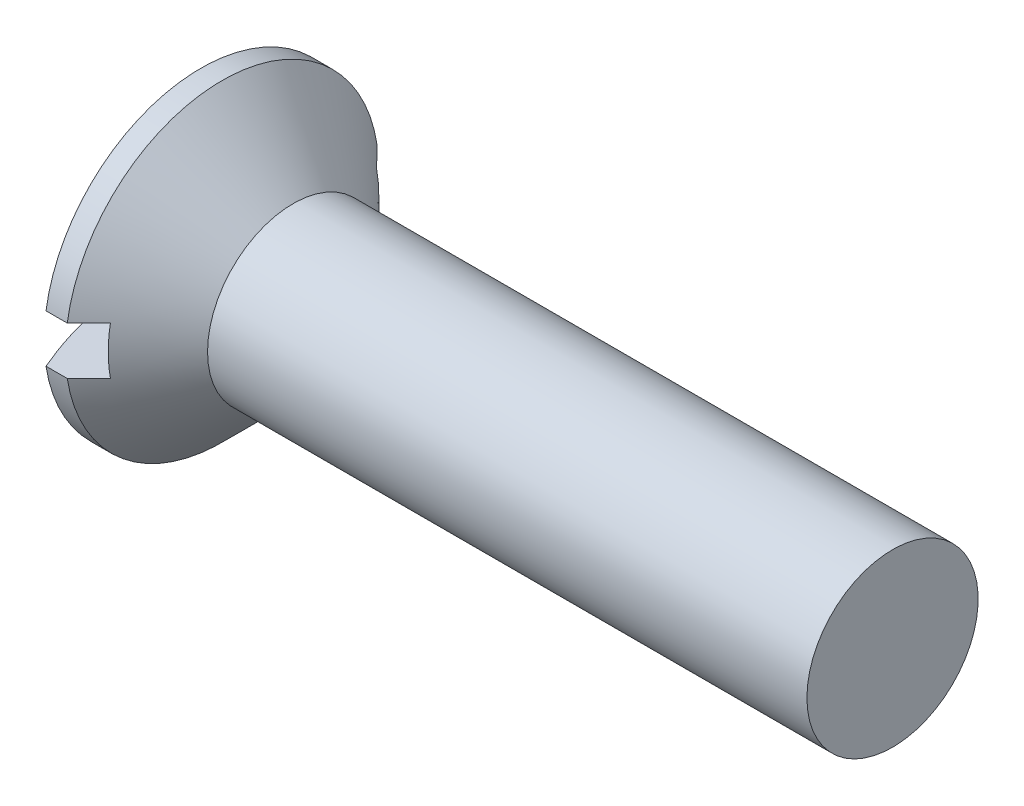
ISO-10303-21;
HEADER;
FILE_DESCRIPTION(('STEP AP214'),'2;1');
FILE_NAME('part.step','',(''),(''),'','','');
FILE_SCHEMA(('AUTOMOTIVE_DESIGN { 1 0 10303 214 1 1 1 1 }'));
ENDSEC;
DATA;
#1=APPLICATION_CONTEXT('core data for automotive mechanical design processes');
#2=APPLICATION_PROTOCOL_DEFINITION('international standard','automotive_design',2000,#1);
#3=PRODUCT_CONTEXT('',#1,'mechanical');
#4=PRODUCT('Part','Part','',(#3));
#5=PRODUCT_RELATED_PRODUCT_CATEGORY('part','',(#4));
#6=PRODUCT_DEFINITION_FORMATION('','',#4);
#7=PRODUCT_DEFINITION_CONTEXT('part definition',#1,'design');
#8=PRODUCT_DEFINITION('design','',#6,#7);
#9=PRODUCT_DEFINITION_SHAPE('','',#8);
#10=(LENGTH_UNIT() NAMED_UNIT(*) SI_UNIT(.MILLI.,.METRE.));
#11=(NAMED_UNIT(*) PLANE_ANGLE_UNIT() SI_UNIT($,.RADIAN.));
#12=(NAMED_UNIT(*) SI_UNIT($,.STERADIAN.) SOLID_ANGLE_UNIT());
#13=UNCERTAINTY_MEASURE_WITH_UNIT(LENGTH_MEASURE(1.E-05),#10,'distance_accuracy_value','');
#14=(GEOMETRIC_REPRESENTATION_CONTEXT(3) GLOBAL_UNCERTAINTY_ASSIGNED_CONTEXT((#13)) GLOBAL_UNIT_ASSIGNED_CONTEXT((#10,
#11,#12)) REPRESENTATION_CONTEXT('',''));
#15=CARTESIAN_POINT('',(0.,0.,0.));
#16=DIRECTION('',(0.,0.,1.));
#17=DIRECTION('',(1.,0.,0.));
#18=AXIS2_PLACEMENT_3D('',#15,#16,#17);
#19=CARTESIAN_POINT('',(4.4,-1.4,-9.15));
#20=DIRECTION('',(1.,0.,0.));
#21=DIRECTION('',(0.,0.,-1.));
#22=AXIS2_PLACEMENT_3D('',#19,#20,#21);
#23=PLANE('',#22);
#24=DIRECTION('',(0.,0.,-1.));
#25=VECTOR('',#24,1.);
#26=CARTESIAN_POINT('',(4.4,0.751153846153878,-9.15));
#27=LINE('',#26,#25);
#28=CARTESIAN_POINT('',(4.4,0.751153846153849,-0.751153846153847));
#29=VERTEX_POINT('',#28);
#30=CARTESIAN_POINT('',(4.4,0.751153846153854,-2.49538461538461));
#31=VERTEX_POINT('',#30);
#32=EDGE_CURVE('E205',#29,#31,#27,.T.);
#33=ORIENTED_EDGE('',*,*,#32,.F.);
#34=DIRECTION('',(0.,-1.,0.));
#35=VECTOR('',#34,1.);
#36=CARTESIAN_POINT('',(4.4,-1.4,-0.751153846153848));
#37=LINE('',#36,#35);
#38=CARTESIAN_POINT('',(4.4,1.4,-0.751153846153848));
#39=VERTEX_POINT('',#38);
#40=EDGE_CURVE('E326',#39,#29,#37,.T.);
#41=ORIENTED_EDGE('',*,*,#40,.F.);
#42=DIRECTION('',(0.,0.,-1.));
#43=VECTOR('',#42,1.);
#44=CARTESIAN_POINT('',(4.4,1.4,9.15));
#45=LINE('',#44,#43);
#46=CARTESIAN_POINT('',(4.4,1.4,-7.77372673048254));
#47=VERTEX_POINT('',#46);
#48=EDGE_CURVE('E57',#39,#47,#45,.T.);
#49=ORIENTED_EDGE('',*,*,#48,.T.);
#50=CARTESIAN_POINT('',(4.4,0.,0.));
#51=DIRECTION('',(1.,0.,0.));
#52=DIRECTION('',(0.,0.,-1.));
#53=AXIS2_PLACEMENT_3D('',#50,#51,#52);
#54=CIRCLE('',#53,7.89878644351262);
#55=CARTESIAN_POINT('',(4.4,-1.4,-7.77372673048254));
#56=VERTEX_POINT('',#55);
#57=EDGE_CURVE('E267',#56,#47,#54,.T.);
#58=ORIENTED_EDGE('',*,*,#57,.F.);
#59=DIRECTION('',(0.,0.,1.));
#60=VECTOR('',#59,1.);
#61=CARTESIAN_POINT('',(4.4,-1.4,-9.15));
#62=LINE('',#61,#60);
#63=CARTESIAN_POINT('',(4.4,-1.4,-0.751153846153848));
#64=VERTEX_POINT('',#63);
#65=EDGE_CURVE('E230',#56,#64,#62,.T.);
#66=ORIENTED_EDGE('',*,*,#65,.T.);
#67=CARTESIAN_POINT('',(4.4,-0.751153846153843,-0.751153846153847));
#68=VERTEX_POINT('',#67);
#69=EDGE_CURVE('E336',#68,#64,#37,.T.);
#70=ORIENTED_EDGE('',*,*,#69,.F.);
#71=DIRECTION('',(0.,0.,1.));
#72=VECTOR('',#71,1.);
#73=CARTESIAN_POINT('',(4.4,-0.751153846153813,-9.15));
#74=LINE('',#73,#72);
#75=CARTESIAN_POINT('',(4.4,-0.751153846153837,-2.49538461538462));
#76=VERTEX_POINT('',#75);
#77=EDGE_CURVE('E386',#76,#68,#74,.T.);
#78=ORIENTED_EDGE('',*,*,#77,.F.);
#79=DIRECTION('',(0.,1.,0.));
#80=VECTOR('',#79,1.);
#81=CARTESIAN_POINT('',(4.4,-1.40000000000002,-2.49538461538462));
#82=LINE('',#81,#80);
#83=EDGE_CURVE('E176',#76,#31,#82,.T.);
#84=ORIENTED_EDGE('',*,*,#83,.T.);
#85=EDGE_LOOP('',(#33,#41,#49,#58,#66,#70,#78,#84));
#86=FACE_BOUND('',#85,.T.);
#87=ADVANCED_FACE('F34',(#86),#23,.F.);
#88=DIRECTION('',(0.,0.,-1.));
#89=VECTOR('',#88,1.);
#90=CARTESIAN_POINT('',(4.4,0.751153846153878,-9.15));
#91=LINE('',#90,#89);
#92=CARTESIAN_POINT('',(4.4,0.751153846153837,2.49538461538461));
#93=VERTEX_POINT('',#92);
#94=CARTESIAN_POINT('',(4.4,0.751153846153844,0.751153846153845));
#95=VERTEX_POINT('',#94);
#96=EDGE_CURVE('E164',#93,#95,#91,.T.);
#97=ORIENTED_EDGE('',*,*,#96,.F.);
#98=DIRECTION('',(0.,-1.,0.));
#99=VECTOR('',#98,1.);
#100=CARTESIAN_POINT('',(4.4,-1.40000000000004,2.49538461538461));
#101=LINE('',#100,#99);
#102=CARTESIAN_POINT('',(4.4,-0.751153846153854,2.49538461538461));
#103=VERTEX_POINT('',#102);
#104=EDGE_CURVE('E175',#93,#103,#101,.T.);
#105=ORIENTED_EDGE('',*,*,#104,.T.);
#106=DIRECTION('',(0.,0.,1.));
#107=VECTOR('',#106,1.);
#108=CARTESIAN_POINT('',(4.4,-0.751153846153813,-9.15));
#109=LINE('',#108,#107);
#110=CARTESIAN_POINT('',(4.4,-0.751153846153849,0.751153846153845));
#111=VERTEX_POINT('',#110);
#112=EDGE_CURVE('E390',#111,#103,#109,.T.);
#113=ORIENTED_EDGE('',*,*,#112,.F.);
#114=DIRECTION('',(0.,1.,0.));
#115=VECTOR('',#114,1.);
#116=CARTESIAN_POINT('',(4.4,-1.4,0.751153846153844));
#117=LINE('',#116,#115);
#118=CARTESIAN_POINT('',(4.4,-1.4,0.751153846153844));
#119=VERTEX_POINT('',#118);
#120=EDGE_CURVE('E339',#119,#111,#117,.T.);
#121=ORIENTED_EDGE('',*,*,#120,.F.);
#122=CARTESIAN_POINT('',(4.4,-1.4,7.77372673048254));
#123=VERTEX_POINT('',#122);
#124=EDGE_CURVE('E229',#119,#123,#62,.T.);
#125=ORIENTED_EDGE('',*,*,#124,.T.);
#126=CARTESIAN_POINT('',(4.4,1.4,7.77372673048254));
#127=VERTEX_POINT('',#126);
#128=EDGE_CURVE('E271',#127,#123,#54,.T.);
#129=ORIENTED_EDGE('',*,*,#128,.F.);
#130=CARTESIAN_POINT('',(4.4,1.4,0.751153846153845));
#131=VERTEX_POINT('',#130);
#132=EDGE_CURVE('E226',#127,#131,#45,.T.);
#133=ORIENTED_EDGE('',*,*,#132,.T.);
#134=EDGE_CURVE('E356',#95,#131,#117,.T.);
#135=ORIENTED_EDGE('',*,*,#134,.F.);
#136=EDGE_LOOP('',(#97,#105,#113,#121,#125,#129,#133,#135));
#137=FACE_BOUND('',#136,.T.);
#138=ADVANCED_FACE('F317',(#137),#23,.F.);
#139=CARTESIAN_POINT('',(7.91393402264894,0.,-0.484537173806007));
#140=DIRECTION('',(-0.0756566651152588,0.,0.997133927325531));
#141=DIRECTION('',(0.997133927325531,0.,0.0756566651152588));
#142=AXIS2_PLACEMENT_3D('',#139,#140,#141);
#143=PLANE('',#142);
#144=ORIENTED_EDGE('',*,*,#40,.T.);
#145=DIRECTION('',(0.994292357349116,-0.0754410634771884,0.0754410634771882));
#146=VECTOR('',#145,1.);
#147=CARTESIAN_POINT('',(7.95027938516743,0.48177950119534,-0.481779501195338));
#148=LINE('',#147,#146);
#149=CARTESIAN_POINT('',(7.15,0.542500000000002,-0.542499999999998));
#150=VERTEX_POINT('',#149);
#151=EDGE_CURVE('E330',#29,#150,#148,.T.);
#152=ORIENTED_EDGE('',*,*,#151,.T.);
#153=DIRECTION('',(0.813773502738753,-0.577893001420423,0.0617443531798285));
#154=VECTOR('',#153,1.);
#155=CARTESIAN_POINT('',(0.,5.62,-1.085));
#156=LINE('',#155,#154);
#157=CARTESIAN_POINT('',(0.617987345860282,5.18114255264257,-1.03811075033158));
#158=VERTEX_POINT('',#157);
#159=EDGE_CURVE('E187',#158,#150,#156,.T.);
#160=ORIENTED_EDGE('',*,*,#159,.F.);
#161=CARTESIAN_POINT('',(22.8507741936033,0.,0.648782517486683));
#162=DIRECTION('',(-0.0756566651152588,0.,0.997133927325531));
#163=DIRECTION('',(0.997133927325531,0.,0.0756566651152588));
#164=AXIS2_PLACEMENT_3D('',#161,#162,#163);
#165=CIRCLE('',#164,22.8907548600956);
#166=CARTESIAN_POINT('',(0.0683552371710354,1.4,-1.07981360613073));
#167=VERTEX_POINT('',#166);
#168=EDGE_CURVE('E223',#167,#158,#165,.F.);
#169=ORIENTED_EDGE('',*,*,#168,.F.);
#170=DIRECTION('',(0.997133927325531,0.,0.0756566651152588));
#171=VECTOR('',#170,1.);
#172=CARTESIAN_POINT('',(5.14694133934077,1.4,-0.694480324952115));
#173=LINE('',#172,#171);
#174=EDGE_CURVE('E218',#167,#39,#173,.T.);
#175=ORIENTED_EDGE('',*,*,#174,.T.);
#176=EDGE_LOOP('',(#144,#152,#160,#169,#175));
#177=FACE_BOUND('',#176,.T.);
#178=ADVANCED_FACE('F321',(#177),#143,.T.);
#179=DIRECTION('',(0.813773502738753,0.577893001420423,0.0617443531798285));
#180=VECTOR('',#179,1.);
#181=CARTESIAN_POINT('',(0.,-5.62,-1.085));
#182=LINE('',#181,#180);
#183=CARTESIAN_POINT('',(0.617987345860282,-5.18114255264258,-1.03811075033158));
#184=VERTEX_POINT('',#183);
#185=CARTESIAN_POINT('',(7.15,-0.5425,-0.5425));
#186=VERTEX_POINT('',#185);
#187=EDGE_CURVE('E188',#184,#186,#182,.T.);
#188=ORIENTED_EDGE('',*,*,#187,.T.);
#189=DIRECTION('',(-0.994292357349116,-0.0754410634771878,-0.0754410634771882));
#190=VECTOR('',#189,1.);
#191=CARTESIAN_POINT('',(7.95027938516743,-0.481779501195337,-0.481779501195339));
#192=LINE('',#191,#190);
#193=EDGE_CURVE('E388',#186,#68,#192,.T.);
#194=ORIENTED_EDGE('',*,*,#193,.T.);
#195=ORIENTED_EDGE('',*,*,#69,.T.);
#196=DIRECTION('',(-0.997133927325531,0.,-0.0756566651152588));
#197=VECTOR('',#196,1.);
#198=CARTESIAN_POINT('',(3.7663924939912,-1.4,-0.799228261819549));
#199=LINE('',#198,#197);
#200=CARTESIAN_POINT('',(0.0683552371710319,-1.4,-1.07981360613073));
#201=VERTEX_POINT('',#200);
#202=EDGE_CURVE('E216',#64,#201,#199,.T.);
#203=ORIENTED_EDGE('',*,*,#202,.T.);
#204=CARTESIAN_POINT('',(22.8507741936033,0.,0.648782517486683));
#205=DIRECTION('',(-0.0756566651152588,0.,0.997133927325531));
#206=DIRECTION('',(0.997133927325531,0.,0.0756566651152588));
#207=AXIS2_PLACEMENT_3D('',#204,#205,#206);
#208=CIRCLE('',#207,22.8907548600956);
#209=EDGE_CURVE('E220',#184,#201,#208,.F.);
#210=ORIENTED_EDGE('',*,*,#209,.F.);
#211=EDGE_LOOP('',(#188,#194,#195,#203,#210));
#212=FACE_BOUND('',#211,.T.);
#213=ADVANCED_FACE('F373',(#212),#143,.T.);
#214=CARTESIAN_POINT('',(7.91393402264894,0.,0.484537173806007));
#215=DIRECTION('',(-0.0756566651152587,0.,-0.997133927325531));
#216=DIRECTION('',(-0.997133927325531,0.,0.0756566651152587));
#217=AXIS2_PLACEMENT_3D('',#214,#215,#216);
#218=PLANE('',#217);
#219=DIRECTION('',(0.813773502738753,-0.577893001420423,-0.0617443531798285));
#220=VECTOR('',#219,1.);
#221=CARTESIAN_POINT('',(0.,5.62,1.085));
#222=LINE('',#221,#220);
#223=CARTESIAN_POINT('',(0.617987345860278,5.18114255264258,1.03811075033158));
#224=VERTEX_POINT('',#223);
#225=CARTESIAN_POINT('',(7.15,0.542499999999998,0.542500000000002));
#226=VERTEX_POINT('',#225);
#227=EDGE_CURVE('E180',#224,#226,#222,.T.);
#228=ORIENTED_EDGE('',*,*,#227,.T.);
#229=DIRECTION('',(-0.994292357349116,0.0754410634771879,0.0754410634771881));
#230=VECTOR('',#229,1.);
#231=CARTESIAN_POINT('',(7.95027938516743,0.481779501195337,0.481779501195339));
#232=LINE('',#231,#230);
#233=EDGE_CURVE('E11',#226,#95,#232,.T.);
#234=ORIENTED_EDGE('',*,*,#233,.T.);
#235=ORIENTED_EDGE('',*,*,#134,.T.);
#236=DIRECTION('',(-0.997133927325531,0.,0.0756566651152587));
#237=VECTOR('',#236,1.);
#238=CARTESIAN_POINT('',(3.7663924939912,1.4,0.799228261819549));
#239=LINE('',#238,#237);
#240=CARTESIAN_POINT('',(0.0683552371710319,1.4,1.07981360613073));
#241=VERTEX_POINT('',#240);
#242=EDGE_CURVE('E210',#131,#241,#239,.T.);
#243=ORIENTED_EDGE('',*,*,#242,.T.);
#244=CARTESIAN_POINT('',(22.8507741936033,0.,-0.648782517486681));
#245=DIRECTION('',(-0.0756566651152587,0.,-0.997133927325531));
#246=DIRECTION('',(-0.997133927325531,0.,0.0756566651152587));
#247=AXIS2_PLACEMENT_3D('',#244,#245,#246);
#248=CIRCLE('',#247,22.8907548600956);
#249=EDGE_CURVE('E183',#224,#241,#248,.F.);
#250=ORIENTED_EDGE('',*,*,#249,.F.);
#251=EDGE_LOOP('',(#228,#234,#235,#243,#250));
#252=FACE_BOUND('',#251,.T.);
#253=ADVANCED_FACE('F181',(#252),#218,.T.);
#254=ORIENTED_EDGE('',*,*,#120,.T.);
#255=DIRECTION('',(0.994292357349116,0.0754410634771883,-0.0754410634771881));
#256=VECTOR('',#255,1.);
#257=CARTESIAN_POINT('',(7.95027938516743,-0.48177950119534,0.481779501195338));
#258=LINE('',#257,#256);
#259=CARTESIAN_POINT('',(7.15,-0.5425,0.5425));
#260=VERTEX_POINT('',#259);
#261=EDGE_CURVE('E392',#111,#260,#258,.T.);
#262=ORIENTED_EDGE('',*,*,#261,.T.);
#263=DIRECTION('',(0.813773502738753,0.577893001420422,-0.0617443531798284));
#264=VECTOR('',#263,1.);
#265=CARTESIAN_POINT('',(0.,-5.62,1.085));
#266=LINE('',#265,#264);
#267=CARTESIAN_POINT('',(0.617987345860282,-5.18114255264258,1.03811075033158));
#268=VERTEX_POINT('',#267);
#269=EDGE_CURVE('E379',#268,#260,#266,.T.);
#270=ORIENTED_EDGE('',*,*,#269,.F.);
#271=CARTESIAN_POINT('',(22.8507741936033,0.,-0.648782517486681));
#272=DIRECTION('',(-0.0756566651152587,0.,-0.997133927325531));
#273=DIRECTION('',(-0.997133927325531,0.,0.0756566651152587));
#274=AXIS2_PLACEMENT_3D('',#271,#272,#273);
#275=CIRCLE('',#274,22.8907548600956);
#276=CARTESIAN_POINT('',(0.0683552371710319,-1.4,1.07981360613073));
#277=VERTEX_POINT('',#276);
#278=EDGE_CURVE('E212',#277,#268,#275,.F.);
#279=ORIENTED_EDGE('',*,*,#278,.F.);
#280=DIRECTION('',(0.997133927325531,0.,-0.0756566651152587));
#281=VECTOR('',#280,1.);
#282=CARTESIAN_POINT('',(5.14694133934077,-1.4,0.694480324952115));
#283=LINE('',#282,#281);
#284=EDGE_CURVE('E49',#277,#119,#283,.T.);
#285=ORIENTED_EDGE('',*,*,#284,.T.);
#286=EDGE_LOOP('',(#254,#262,#270,#279,#285));
#287=FACE_BOUND('',#286,.T.);
#288=ADVANCED_FACE('F403',(#287),#218,.T.);
#289=CARTESIAN_POINT('',(22.9,0.,0.));
#290=DIRECTION('',(-1.,0.,0.));
#291=DIRECTION('',(0.,-1.,0.));
#292=AXIS2_PLACEMENT_3D('',#289,#290,#291);
#293=SPHERICAL_SURFACE('',#292,22.9);
#294=CARTESIAN_POINT('',(22.9,1.4,0.));
#295=DIRECTION('',(0.,1.,0.));
#296=DIRECTION('',(0.,0.,1.));
#297=AXIS2_PLACEMENT_3D('',#294,#295,#296);
#298=CIRCLE('',#297,22.8571651785605);
#299=CARTESIAN_POINT('',(1.90744179476927,1.4,-9.0422618851701));
#300=VERTEX_POINT('',#299);
#301=EDGE_CURVE('E246',#167,#300,#298,.F.);
#302=ORIENTED_EDGE('',*,*,#301,.F.);
#303=ORIENTED_EDGE('',*,*,#168,.T.);
#304=CARTESIAN_POINT('',(17.8760956364067,-7.07452805508461,0.));
#305=DIRECTION('',(0.57899773071887,0.815329153055622,0.));
#306=DIRECTION('',(-0.815329153055622,0.57899773071887,0.));
#307=AXIS2_PLACEMENT_3D('',#304,#305,#306);
#308=CIRCLE('',#307,21.1924854074101);
#309=EDGE_CURVE('E42',#224,#158,#308,.F.);
#310=ORIENTED_EDGE('',*,*,#309,.F.);
#311=ORIENTED_EDGE('',*,*,#249,.T.);
#312=CARTESIAN_POINT('',(1.90744179476927,1.4,9.04226188517011));
#313=VERTEX_POINT('',#312);
#314=EDGE_CURVE('E247',#313,#241,#298,.F.);
#315=ORIENTED_EDGE('',*,*,#314,.F.);
#316=CARTESIAN_POINT('',(1.90744179476927,0.,0.));
#317=DIRECTION('',(-1.,0.,0.));
#318=DIRECTION('',(0.,0.,1.));
#319=AXIS2_PLACEMENT_3D('',#316,#317,#318);
#320=CIRCLE('',#319,9.15);
#321=EDGE_CURVE('E266',#313,#300,#320,.T.);
#322=ORIENTED_EDGE('',*,*,#321,.T.);
#323=EDGE_LOOP('',(#302,#303,#310,#311,#315,#322));
#324=FACE_BOUND('',#323,.T.);
#325=ADVANCED_FACE('F343',(#324),#293,.T.);
#326=CARTESIAN_POINT('',(17.8760956364067,7.07452805508461,0.));
#327=DIRECTION('',(0.57899773071887,-0.815329153055622,0.));
#328=DIRECTION('',(0.815329153055622,0.57899773071887,0.));
#329=AXIS2_PLACEMENT_3D('',#326,#327,#328);
#330=CIRCLE('',#329,21.1924854074101);
#331=EDGE_CURVE('E335',#184,#268,#330,.F.);
#332=ORIENTED_EDGE('',*,*,#331,.F.);
#333=ORIENTED_EDGE('',*,*,#209,.T.);
#334=CARTESIAN_POINT('',(22.9,-1.4,0.));
#335=DIRECTION('',(0.,-1.,0.));
#336=DIRECTION('',(0.,0.,-1.));
#337=AXIS2_PLACEMENT_3D('',#334,#335,#336);
#338=CIRCLE('',#337,22.8571651785605);
#339=CARTESIAN_POINT('',(1.90744179476927,-1.4,-9.04226188517011));
#340=VERTEX_POINT('',#339);
#341=EDGE_CURVE('E237',#340,#201,#338,.F.);
#342=ORIENTED_EDGE('',*,*,#341,.F.);
#343=CARTESIAN_POINT('',(1.90744179476927,-1.4,9.0422618851701));
#344=VERTEX_POINT('',#343);
#345=EDGE_CURVE('E263',#340,#344,#320,.T.);
#346=ORIENTED_EDGE('',*,*,#345,.T.);
#347=EDGE_CURVE('E236',#277,#344,#338,.F.);
#348=ORIENTED_EDGE('',*,*,#347,.F.);
#349=ORIENTED_EDGE('',*,*,#278,.T.);
#350=EDGE_LOOP('',(#332,#333,#342,#346,#348,#349));
#351=FACE_BOUND('',#350,.T.);
#352=ADVANCED_FACE('F303',(#351),#293,.T.);
#353=CARTESIAN_POINT('',(4.4,1.4,9.15));
#354=DIRECTION('',(0.,1.,0.));
#355=DIRECTION('',(0.,0.,1.));
#356=AXIS2_PLACEMENT_3D('',#353,#354,#355);
#357=PLANE('',#356);
#358=ORIENTED_EDGE('',*,*,#174,.F.);
#359=ORIENTED_EDGE('',*,*,#301,.T.);
#360=DIRECTION('',(-1.,0.,0.));
#361=VECTOR('',#360,1.);
#362=CARTESIAN_POINT('',(-15.875,1.4,-9.0422618851701));
#363=LINE('',#362,#361);
#364=CARTESIAN_POINT('',(3.14878644351263,1.4,-9.0422618851701));
#365=VERTEX_POINT('',#364);
#366=EDGE_CURVE('E243',#365,#300,#363,.T.);
#367=ORIENTED_EDGE('',*,*,#366,.F.);
#368=CARTESIAN_POINT('',(-7.857048146597,1.4,20.1071546476338));
#369=CARTESIAN_POINT('',(-7.16240173454339,1.4,19.4108129604451));
#370=CARTESIAN_POINT('',(-6.4678297758022,1.4,18.7143969459536));
#371=CARTESIAN_POINT('',(-5.0789137994183,1.4,17.3213021944131));
#372=CARTESIAN_POINT('',(-4.384569788051,1.4,16.6246234511077));
#373=CARTESIAN_POINT('',(-2.9958169251593,1.4,15.2305158546289));
#374=CARTESIAN_POINT('',(-2.30140827464231,1.4,14.5330868011787));
#375=CARTESIAN_POINT('',(-0.913133661235677,1.4,13.1377232868626));
#376=CARTESIAN_POINT('',(-0.219267685269571,1.4,12.4397888390074));
#377=CARTESIAN_POINT('',(1.16766516004261,1.4,11.0430452680403));
#378=CARTESIAN_POINT('',(1.860731980637,1.4,10.3442360964824));
#379=CARTESIAN_POINT('',(2.89921288895363,1.4,9.29486121439367));
#380=CARTESIAN_POINT('',(3.24519991186702,1.4,8.94486259435679));
#381=CARTESIAN_POINT('',(3.93662486381058,1.4,8.24432826145728));
#382=CARTESIAN_POINT('',(4.28206279690165,1.4,7.89379255260482));
#383=CARTESIAN_POINT('',(4.97201098407667,1.4,7.19206058266475));
#384=CARTESIAN_POINT('',(5.31652153057943,1.4,6.84086460915768));
#385=CARTESIAN_POINT('',(6.0043198550081,1.4,6.1372554152688));
#386=CARTESIAN_POINT('',(6.34760759767043,1.4,5.78484216035078));
#387=CARTESIAN_POINT('',(6.86094083207756,1.4,5.25471885267416));
#388=CARTESIAN_POINT('',(7.03177435251846,1.4,5.07777217670582));
#389=CARTESIAN_POINT('',(7.3727219976139,1.4,4.72318743380958));
#390=CARTESIAN_POINT('',(7.54283612457629,1.4,4.5455493691032));
#391=CARTESIAN_POINT('',(7.88205567895868,1.4,4.18932774848586));
#392=CARTESIAN_POINT('',(8.05116115256099,1.4,4.010744236581));
#393=CARTESIAN_POINT('',(8.38792170913193,1.4,3.6522159938797));
#394=CARTESIAN_POINT('',(8.55557681829037,1.4,3.47227128777332));
#395=CARTESIAN_POINT('',(8.76748560072488,1.4,3.24198243681544));
#396=CARTESIAN_POINT('',(8.81277819707361,1.4,3.19259415231655));
#397=CARTESIAN_POINT('',(8.90317039805928,1.4,3.09364104016524));
#398=CARTESIAN_POINT('',(8.94827000208926,1.4,3.0440762119585));
#399=CARTESIAN_POINT('',(9.08324361960469,1.4,2.8950805018967));
#400=CARTESIAN_POINT('',(9.17278950728053,1.4,2.79535157355364));
#401=CARTESIAN_POINT('',(9.3508320888316,1.4,2.59472118043883));
#402=CARTESIAN_POINT('',(9.43932721937955,1.4,2.4938183259168));
#403=CARTESIAN_POINT('',(9.614699972968,1.4,2.29062509774684));
#404=CARTESIAN_POINT('',(9.70157772808994,1.4,2.18833483858974));
#405=CARTESIAN_POINT('',(9.85908268519032,1.4,1.99861822286032));
#406=CARTESIAN_POINT('',(9.93005523883935,1.4,1.91147949716551));
#407=CARTESIAN_POINT('',(10.0697225589233,1.4,1.73539857671608));
#408=CARTESIAN_POINT('',(10.1384175632151,1.4,1.64645657186115));
#409=CARTESIAN_POINT('',(10.2724705720187,1.4,1.46615153054903));
#410=CARTESIAN_POINT('',(10.3378304303692,1.4,1.37478988291309));
#411=CARTESIAN_POINT('',(10.4635064959422,1.4,1.18868577560423));
#412=CARTESIAN_POINT('',(10.5238261057651,1.4,1.09394565935052));
#413=CARTESIAN_POINT('',(10.6326133150829,1.4,0.906410779158184));
#414=CARTESIAN_POINT('',(10.6816099494598,1.4,0.813927939950042));
#415=CARTESIAN_POINT('',(10.768441254158,1.4,0.623741334762394));
#416=CARTESIAN_POINT('',(10.8062957802322,1.4,0.526047227156338));
#417=CARTESIAN_POINT('',(10.8471996480684,1.4,0.385477581345689));
#418=CARTESIAN_POINT('',(10.8575324900997,1.4,0.344715229152776));
#419=CARTESIAN_POINT('',(10.8749530279124,1.4,0.262512597980199));
#420=CARTESIAN_POINT('',(10.882042416588,1.4,0.22107268437381));
#421=CARTESIAN_POINT('',(10.8926248599701,1.4,0.137809044984982));
#422=CARTESIAN_POINT('',(10.896124636229,1.4,0.0959861850436));
#423=CARTESIAN_POINT('',(10.8993592539135,1.4,0.0121930480465017));
#424=CARTESIAN_POINT('',(10.899094143624,1.4,-0.0297772271117035));
#425=CARTESIAN_POINT('',(10.8948149534949,1.4,-0.113507966191157));
#426=CARTESIAN_POINT('',(10.8908022173129,1.4,-0.155268499917299));
#427=CARTESIAN_POINT('',(10.8792459740393,1.4,-0.238299671163265));
#428=CARTESIAN_POINT('',(10.8717017006016,1.4,-0.279570200357654));
#429=CARTESIAN_POINT('',(10.8534259161864,1.4,-0.361477258398673));
#430=CARTESIAN_POINT('',(10.8426880522661,1.4,-0.402112351974105));
#431=CARTESIAN_POINT('',(10.8184565568997,1.4,-0.482540705127475));
#432=CARTESIAN_POINT('',(10.8049629204321,1.4,-0.522333963171272));
#433=CARTESIAN_POINT('',(10.7534817229732,1.4,-0.66062373817725));
#434=CARTESIAN_POINT('',(10.7093295480848,1.4,-0.756824096864698));
#435=CARTESIAN_POINT('',(10.611885326994,1.4,-0.944505351940633));
#436=CARTESIAN_POINT('',(10.5585722859902,1.4,-1.03597476523033));
#437=CARTESIAN_POINT('',(10.4457034448116,1.4,-1.21608752073851));
#438=CARTESIAN_POINT('',(10.3860957462745,1.4,-1.30469799229635));
#439=CARTESIAN_POINT('',(10.2938557677635,1.4,-1.4355101257757));
#440=CARTESIAN_POINT('',(10.2626548857484,1.4,-1.47874135004981));
#441=CARTESIAN_POINT('',(10.1994575270918,1.4,-1.56461754012874));
#442=CARTESIAN_POINT('',(10.1674610779967,1.4,-1.60726252615286));
#443=CARTESIAN_POINT('',(10.0628879562799,1.4,-1.74442534089264));
#444=CARTESIAN_POINT('',(9.98900731385959,1.4,-1.83794788506663));
#445=CARTESIAN_POINT('',(9.83902850276875,1.4,-2.02320270323648));
#446=CARTESIAN_POINT('',(9.76293004312599,1.4,-2.11493473966193));
#447=CARTESIAN_POINT('',(9.60912484168818,1.4,-2.29709862281036));
#448=CARTESIAN_POINT('',(9.53141748345873,1.4,-2.38752994781703));
#449=CARTESIAN_POINT('',(9.37483606047006,1.4,-2.56737831217361));
#450=CARTESIAN_POINT('',(9.29596196265418,1.4,-2.65679532265813));
#451=CARTESIAN_POINT('',(9.05779287389105,1.4,-2.92415166595302));
#452=CARTESIAN_POINT('',(8.89718647029795,1.4,-3.10092142858316));
#453=CARTESIAN_POINT('',(8.57389696740277,1.4,-3.45246333870868));
#454=CARTESIAN_POINT('',(8.41121436586402,1.4,-3.62723594665571));
#455=CARTESIAN_POINT('',(8.08537487251062,1.4,-3.97447019281041));
#456=CARTESIAN_POINT('',(7.92222595701649,1.4,-4.14693932344164));
#457=CARTESIAN_POINT('',(7.59495611049466,1.4,-4.49097115507894));
#458=CARTESIAN_POINT('',(7.43083512155191,1.4,-4.6625338009017));
#459=CARTESIAN_POINT('',(7.10204178600474,1.4,-5.00483942893845));
#460=CARTESIAN_POINT('',(6.93737005150631,1.4,-5.17558299948488));
#461=CARTESIAN_POINT('',(6.60751048719549,1.4,-5.51656403220254));
#462=CARTESIAN_POINT('',(6.44232266764926,1.4,-5.68680150431145));
#463=CARTESIAN_POINT('',(5.9863704667772,1.4,-6.1556036785396));
#464=CARTESIAN_POINT('',(5.69519498223811,1.4,-6.45376844863838));
#465=CARTESIAN_POINT('',(5.11204491625998,1.4,-7.04931578921057));
#466=CARTESIAN_POINT('',(4.82007033331758,1.4,-7.34669835821034));
#467=CARTESIAN_POINT('',(3.94332156132855,1.4,-8.23804831778499));
#468=CARTESIAN_POINT('',(3.35772932502353,1.4,-8.83121081657676));
#469=CARTESIAN_POINT('',(2.18515182482223,1.4,-10.0166346047705));
#470=CARTESIAN_POINT('',(1.5981660901182,1.4,-10.608895427841));
#471=CARTESIAN_POINT('',(0.423490142339192,1.4,-11.7927119429328));
#472=CARTESIAN_POINT('',(-0.164200067090348,1.4,-12.3842676385716));
#473=CARTESIAN_POINT('',(-1.3437173604148,1.4,-13.57062832245));
#474=CARTESIAN_POINT('',(-1.93554730660023,1.4,-14.1654304639677));
#475=CARTESIAN_POINT('',(-3.11952448746137,1.4,-15.3547209005296));
#476=CARTESIAN_POINT('',(-3.71167172268395,1.4,-15.9492091950294));
#477=CARTESIAN_POINT('',(-4.89593038537907,1.4,-17.1377013051511));
#478=CARTESIAN_POINT('',(-5.4880417144001,1.4,-17.7317052188847));
#479=CARTESIAN_POINT('',(-6.67243238017531,1.4,-18.9195432987571));
#480=CARTESIAN_POINT('',(-7.26471171661067,1.4,-19.5133774652138));
#481=CARTESIAN_POINT('',(-7.857048146597,1.4,-20.1071546476338));
#482=B_SPLINE_CURVE_WITH_KNOTS('',3,(#368,#369,#370,#371,#372,#373,#374,#375,#376,#377,#378,
#379,#380,#381,#382,#383,#384,#385,#386,#387,#388,#389,#390,#391,#392,#393,#394,#395,#396,#397,
#398,#399,#400,#401,#402,#403,#404,#405,#406,#407,#408,#409,#410,#411,#412,#413,#414,#415,#416,
#417,#418,#419,#420,#421,#422,#423,#424,#425,#426,#427,#428,#429,#430,#431,#432,#433,#434,#435,
#436,#437,#438,#439,#440,#441,#442,#443,#444,#445,#446,#447,#448,#449,#450,#451,#452,#453,#454,
#455,#456,#457,#458,#459,#460,#461,#462,#463,#464,#465,#466,#467,#468,#469,#470,#471,#472,#473,
#474,#475,#476,#477,#478,#479,#480,#481),.UNSPECIFIED.,.F.,.F.,(4,2,2,2,2,2,2,2,2,2,2,2,2,2,2,2,
2,2,2,2,2,2,2,2,2,2,2,2,2,2,2,2,2,2,2,2,2,2,2,2,2,2,2,2,2,2,2,2,2,2,2,2,2,2,2,2,4),(0.,
2.95073359407433,5.90154255818966,8.85408293577678,11.8065498294877,14.7591881989668,
16.2356208592745,17.7120425490257,19.1879257011809,20.6638510761937,21.4017169027718,
22.1395803604379,22.8774097708,23.6152258299532,23.8162616875221,24.0172981768781,
24.4193841275236,24.822007818635,25.2245984843388,25.5617262926141,25.8988187811676,
26.235721809078,26.5723955294152,26.8859876715845,27.199017546805,27.3250632696833,
27.4510431287469,27.5767866573558,27.7025285732978,27.8282254235802,27.95394956282,
28.0799254946008,28.2059016559374,28.5225219893391,28.8398778721668,29.1600918734327,
29.3200304264684,29.4799634493304,29.8374587586641,30.195001183552,30.5526832297956,
30.9103754295592,31.6268452767873,32.3431464638664,33.0553686393294,33.7676336838244,
34.4792720911143,35.1908964312364,36.4411611781847,37.6914282788898,40.191992435808,
42.6935766385267,45.1951479517227,47.7123824981423,50.2296213972852,52.7457549587565,
55.2618837771683),.UNSPECIFIED.);
#483=EDGE_CURVE('E280',#47,#365,#482,.T.);
#484=ORIENTED_EDGE('',*,*,#483,.F.);
#485=ORIENTED_EDGE('',*,*,#48,.F.);
#486=EDGE_LOOP('',(#358,#359,#367,#484,#485));
#487=FACE_BOUND('',#486,.T.);
#488=ADVANCED_FACE('F300',(#487),#357,.F.);
#489=ORIENTED_EDGE('',*,*,#242,.F.);
#490=ORIENTED_EDGE('',*,*,#132,.F.);
#491=CARTESIAN_POINT('',(3.14878644351263,1.4,9.0422618851701));
#492=VERTEX_POINT('',#491);
#493=EDGE_CURVE('E355',#492,#127,#482,.T.);
#494=ORIENTED_EDGE('',*,*,#493,.F.);
#495=DIRECTION('',(-1.,0.,0.));
#496=VECTOR('',#495,1.);
#497=CARTESIAN_POINT('',(-15.875,1.4,9.0422618851701));
#498=LINE('',#497,#496);
#499=EDGE_CURVE('E250',#313,#492,#498,.F.);
#500=ORIENTED_EDGE('',*,*,#499,.F.);
#501=ORIENTED_EDGE('',*,*,#314,.T.);
#502=EDGE_LOOP('',(#489,#490,#494,#500,#501));
#503=FACE_BOUND('',#502,.T.);
#504=ADVANCED_FACE('F297',(#503),#357,.F.);
#505=CARTESIAN_POINT('',(4.4,-1.4,-9.15));
#506=DIRECTION('',(0.,-1.,0.));
#507=DIRECTION('',(0.,0.,-1.));
#508=AXIS2_PLACEMENT_3D('',#505,#506,#507);
#509=PLANE('',#508);
#510=ORIENTED_EDGE('',*,*,#202,.F.);
#511=ORIENTED_EDGE('',*,*,#65,.F.);
#512=CARTESIAN_POINT('',(-7.85704814659701,-1.4,-20.1071546476338));
#513=CARTESIAN_POINT('',(-7.16240173454339,-1.4,-19.4108129604451));
#514=CARTESIAN_POINT('',(-6.46782977580221,-1.4,-18.7143969459537));
#515=CARTESIAN_POINT('',(-5.07891379941831,-1.4,-17.3213021944131));
#516=CARTESIAN_POINT('',(-4.38456978805102,-1.4,-16.6246234511077));
#517=CARTESIAN_POINT('',(-2.99581692515932,-1.4,-15.230515854629));
#518=CARTESIAN_POINT('',(-2.30140827464233,-1.4,-14.5330868011788));
#519=CARTESIAN_POINT('',(-0.913133661235703,-1.4,-13.1377232868626));
#520=CARTESIAN_POINT('',(-0.2192676852696,-1.4,-12.4397888390075));
#521=CARTESIAN_POINT('',(1.16766516004258,-1.4,-11.0430452680403));
#522=CARTESIAN_POINT('',(1.86073198063698,-1.4,-10.3442360964825));
#523=CARTESIAN_POINT('',(2.89921288895361,-1.4,-9.29486121439369));
#524=CARTESIAN_POINT('',(3.245199911867,-1.4,-8.94486259435681));
#525=CARTESIAN_POINT('',(3.93662486381056,-1.4,-8.2443282614573));
#526=CARTESIAN_POINT('',(4.28206279690164,-1.4,-7.89379255260484));
#527=CARTESIAN_POINT('',(4.97201098407666,-1.4,-7.19206058266476));
#528=CARTESIAN_POINT('',(5.31652153057942,-1.4,-6.84086460915769));
#529=CARTESIAN_POINT('',(6.0043198550081,-1.4,-6.1372554152688));
#530=CARTESIAN_POINT('',(6.34760759767043,-1.4,-5.78484216035078));
#531=CARTESIAN_POINT('',(6.86094083207756,-1.4,-5.25471885267416));
#532=CARTESIAN_POINT('',(7.03177435251846,-1.4,-5.07777217670582));
#533=CARTESIAN_POINT('',(7.3727219976139,-1.4,-4.72318743380958));
#534=CARTESIAN_POINT('',(7.54283612457629,-1.4,-4.5455493691032));
#535=CARTESIAN_POINT('',(7.88205567895868,-1.4,-4.18932774848585));
#536=CARTESIAN_POINT('',(8.05116115256099,-1.4,-4.010744236581));
#537=CARTESIAN_POINT('',(8.38792170913193,-1.4,-3.6522159938797));
#538=CARTESIAN_POINT('',(8.55557681829037,-1.4,-3.47227128777332));
#539=CARTESIAN_POINT('',(8.76748560072488,-1.4,-3.24198243681544));
#540=CARTESIAN_POINT('',(8.81277819707361,-1.4,-3.19259415231655));
#541=CARTESIAN_POINT('',(8.90317039805928,-1.4,-3.09364104016524));
#542=CARTESIAN_POINT('',(8.94827000208926,-1.4,-3.04407621195849));
#543=CARTESIAN_POINT('',(9.08324361960469,-1.4,-2.8950805018967));
#544=CARTESIAN_POINT('',(9.17278950728053,-1.4,-2.79535157355364));
#545=CARTESIAN_POINT('',(9.3508320888316,-1.4,-2.59472118043883));
#546=CARTESIAN_POINT('',(9.43932721937955,-1.4,-2.49381832591679));
#547=CARTESIAN_POINT('',(9.614699972968,-1.4,-2.29062509774683));
#548=CARTESIAN_POINT('',(9.70157772808994,-1.4,-2.18833483858974));
#549=CARTESIAN_POINT('',(9.85908268519032,-1.4,-1.99861822286031));
#550=CARTESIAN_POINT('',(9.93005523883936,-1.4,-1.91147949716551));
#551=CARTESIAN_POINT('',(10.0697225589233,-1.4,-1.73539857671608));
#552=CARTESIAN_POINT('',(10.1384175632151,-1.4,-1.64645657186115));
#553=CARTESIAN_POINT('',(10.2724705720187,-1.4,-1.46615153054904));
#554=CARTESIAN_POINT('',(10.3378304303692,-1.4,-1.37478988291309));
#555=CARTESIAN_POINT('',(10.4635064959422,-1.4,-1.18868577560423));
#556=CARTESIAN_POINT('',(10.5238261057651,-1.4,-1.09394565935053));
#557=CARTESIAN_POINT('',(10.6326133150829,-1.4,-0.906410779158186));
#558=CARTESIAN_POINT('',(10.6816099494598,-1.4,-0.813927939950045));
#559=CARTESIAN_POINT('',(10.768441254158,-1.4,-0.623741334762397));
#560=CARTESIAN_POINT('',(10.8062957802322,-1.4,-0.526047227156341));
#561=CARTESIAN_POINT('',(10.8471996480684,-1.4,-0.385477581345692));
#562=CARTESIAN_POINT('',(10.8575324900997,-1.4,-0.344715229152779));
#563=CARTESIAN_POINT('',(10.8749530279124,-1.4,-0.262512597980203));
#564=CARTESIAN_POINT('',(10.882042416588,-1.4,-0.221072684373813));
#565=CARTESIAN_POINT('',(10.8926248599701,-1.4,-0.137809044984985));
#566=CARTESIAN_POINT('',(10.896124636229,-1.4,-0.0959861850436033));
#567=CARTESIAN_POINT('',(10.8993592539135,-1.4,-0.012193048046505));
#568=CARTESIAN_POINT('',(10.899094143624,-1.4,0.0297772271117003));
#569=CARTESIAN_POINT('',(10.8948149534949,-1.4,0.113507966191154));
#570=CARTESIAN_POINT('',(10.8908022173129,-1.4,0.155268499917297));
#571=CARTESIAN_POINT('',(10.8792459740393,-1.4,0.238299671163262));
#572=CARTESIAN_POINT('',(10.8717017006016,-1.4,0.279570200357651));
#573=CARTESIAN_POINT('',(10.8534259161864,-1.4,0.36147725839867));
#574=CARTESIAN_POINT('',(10.8426880522661,-1.4,0.402112351974102));
#575=CARTESIAN_POINT('',(10.8184565568997,-1.4,0.482540705127473));
#576=CARTESIAN_POINT('',(10.8049629204321,-1.4,0.522333963171269));
#577=CARTESIAN_POINT('',(10.7534817229732,-1.4,0.660623738177247));
#578=CARTESIAN_POINT('',(10.7093295480848,-1.4,0.756824096864694));
#579=CARTESIAN_POINT('',(10.611885326994,-1.4,0.944505351940628));
#580=CARTESIAN_POINT('',(10.5585722859902,-1.4,1.03597476523033));
#581=CARTESIAN_POINT('',(10.4457034448116,-1.4,1.2160875207385));
#582=CARTESIAN_POINT('',(10.3860957462745,-1.4,1.30469799229634));
#583=CARTESIAN_POINT('',(10.2938557677635,-1.4,1.4355101257757));
#584=CARTESIAN_POINT('',(10.2626548857484,-1.4,1.4787413500498));
#585=CARTESIAN_POINT('',(10.1994575270918,-1.4,1.56461754012873));
#586=CARTESIAN_POINT('',(10.1674610779967,-1.4,1.60726252615285));
#587=CARTESIAN_POINT('',(10.0628879562799,-1.4,1.74442534089263));
#588=CARTESIAN_POINT('',(9.9890073138596,-1.4,1.83794788506662));
#589=CARTESIAN_POINT('',(9.83902850276876,-1.4,2.02320270323647));
#590=CARTESIAN_POINT('',(9.762930043126,-1.4,2.11493473966192));
#591=CARTESIAN_POINT('',(9.60912484168819,-1.4,2.29709862281035));
#592=CARTESIAN_POINT('',(9.53141748345874,-1.4,2.38752994781701));
#593=CARTESIAN_POINT('',(9.37483606047007,-1.4,2.5673783121736));
#594=CARTESIAN_POINT('',(9.29596196265419,-1.4,2.65679532265812));
#595=CARTESIAN_POINT('',(9.05779287389106,-1.4,2.924151665953));
#596=CARTESIAN_POINT('',(8.89718647029796,-1.4,3.10092142858314));
#597=CARTESIAN_POINT('',(8.57389696740278,-1.4,3.45246333870866));
#598=CARTESIAN_POINT('',(8.41121436586404,-1.4,3.62723594665569));
#599=CARTESIAN_POINT('',(8.08537487251064,-1.4,3.9744701928104));
#600=CARTESIAN_POINT('',(7.92222595701651,-1.4,4.14693932344162));
#601=CARTESIAN_POINT('',(7.59495611049469,-1.4,4.49097115507892));
#602=CARTESIAN_POINT('',(7.43083512155193,-1.4,4.66253380090168));
#603=CARTESIAN_POINT('',(7.10204178600477,-1.4,5.00483942893842));
#604=CARTESIAN_POINT('',(6.93737005150634,-1.4,5.17558299948485));
#605=CARTESIAN_POINT('',(6.60751048719552,-1.4,5.51656403220251));
#606=CARTESIAN_POINT('',(6.44232266764929,-1.4,5.68680150431142));
#607=CARTESIAN_POINT('',(5.98637046677723,-1.4,6.15560367853957));
#608=CARTESIAN_POINT('',(5.69519498223814,-1.4,6.45376844863836));
#609=CARTESIAN_POINT('',(5.11204491626,-1.4,7.04931578921054));
#610=CARTESIAN_POINT('',(4.8200703333176,-1.4,7.34669835821031));
#611=CARTESIAN_POINT('',(3.94332156132858,-1.4,8.23804831778496));
#612=CARTESIAN_POINT('',(3.35772932502355,-1.4,8.83121081657673));
#613=CARTESIAN_POINT('',(2.18515182482225,-1.4,10.0166346047705));
#614=CARTESIAN_POINT('',(1.59816609011822,-1.4,10.608895427841));
#615=CARTESIAN_POINT('',(0.423490142339217,-1.4,11.7927119429328));
#616=CARTESIAN_POINT('',(-0.164200067090324,-1.4,12.3842676385716));
#617=CARTESIAN_POINT('',(-1.34371736041478,-1.4,13.57062832245));
#618=CARTESIAN_POINT('',(-1.93554730660021,-1.4,14.1654304639676));
#619=CARTESIAN_POINT('',(-3.11952448746136,-1.4,15.3547209005296));
#620=CARTESIAN_POINT('',(-3.71167172268394,-1.4,15.9492091950294));
#621=CARTESIAN_POINT('',(-4.89593038537906,-1.4,17.1377013051511));
#622=CARTESIAN_POINT('',(-5.4880417144001,-1.4,17.7317052188847));
#623=CARTESIAN_POINT('',(-6.67243238017531,-1.4,18.9195432987571));
#624=CARTESIAN_POINT('',(-7.26471171661067,-1.4,19.5133774652138));
#625=CARTESIAN_POINT('',(-7.857048146597,-1.4,20.1071546476338));
#626=B_SPLINE_CURVE_WITH_KNOTS('',3,(#512,#513,#514,#515,#516,#517,#518,#519,#520,#521,#522,
#523,#524,#525,#526,#527,#528,#529,#530,#531,#532,#533,#534,#535,#536,#537,#538,#539,#540,#541,
#542,#543,#544,#545,#546,#547,#548,#549,#550,#551,#552,#553,#554,#555,#556,#557,#558,#559,#560,
#561,#562,#563,#564,#565,#566,#567,#568,#569,#570,#571,#572,#573,#574,#575,#576,#577,#578,#579,
#580,#581,#582,#583,#584,#585,#586,#587,#588,#589,#590,#591,#592,#593,#594,#595,#596,#597,#598,
#599,#600,#601,#602,#603,#604,#605,#606,#607,#608,#609,#610,#611,#612,#613,#614,#615,#616,#617,
#618,#619,#620,#621,#622,#623,#624,#625),.UNSPECIFIED.,.F.,.F.,(4,2,2,2,2,2,2,2,2,2,2,2,2,2,2,2,
2,2,2,2,2,2,2,2,2,2,2,2,2,2,2,2,2,2,2,2,2,2,2,2,2,2,2,2,2,2,2,2,2,2,2,2,2,2,2,2,4),(0.,
2.95073359407432,5.90154255818964,8.85408293577676,11.8065498294876,14.7591881989668,
16.2356208592745,17.7120425490257,19.1879257011809,20.6638510761937,21.4017169027718,
22.1395803604379,22.8774097708,23.6152258299532,23.8162616875221,24.0172981768781,
24.4193841275236,24.822007818635,25.2245984843388,25.5617262926141,25.8988187811676,
26.235721809078,26.5723955294152,26.8859876715845,27.199017546805,27.3250632696833,
27.4510431287469,27.5767866573559,27.7025285732978,27.8282254235802,27.95394956282,
28.0799254946008,28.2059016559374,28.5225219893391,28.8398778721668,29.1600918734327,
29.3200304264684,29.4799634493304,29.8374587586641,30.195001183552,30.5526832297956,
30.9103754295591,31.6268452767873,32.3431464638664,33.0553686393294,33.7676336838244,
34.4792720911142,35.1908964312364,36.4411611781847,37.6914282788898,40.191992435808,
42.6935766385266,45.1951479517226,47.7123824981422,50.2296213972852,52.7457549587565,
55.2618837771683),.UNSPECIFIED.);
#627=CARTESIAN_POINT('',(3.14878644351263,-1.4,-9.0422618851701));
#628=VERTEX_POINT('',#627);
#629=EDGE_CURVE('E270',#628,#56,#626,.T.);
#630=ORIENTED_EDGE('',*,*,#629,.F.);
#631=DIRECTION('',(-1.,0.,0.));
#632=VECTOR('',#631,1.);
#633=CARTESIAN_POINT('',(-15.875,-1.4,-9.0422618851701));
#634=LINE('',#633,#632);
#635=EDGE_CURVE('E240',#340,#628,#634,.F.);
#636=ORIENTED_EDGE('',*,*,#635,.F.);
#637=ORIENTED_EDGE('',*,*,#341,.T.);
#638=EDGE_LOOP('',(#510,#511,#630,#636,#637));
#639=FACE_BOUND('',#638,.T.);
#640=ADVANCED_FACE('F292',(#639),#509,.F.);
#641=ORIENTED_EDGE('',*,*,#284,.F.);
#642=ORIENTED_EDGE('',*,*,#347,.T.);
#643=DIRECTION('',(-1.,0.,0.));
#644=VECTOR('',#643,1.);
#645=CARTESIAN_POINT('',(-15.875,-1.4,9.0422618851701));
#646=LINE('',#645,#644);
#647=CARTESIAN_POINT('',(3.14878644351263,-1.4,9.0422618851701));
#648=VERTEX_POINT('',#647);
#649=EDGE_CURVE('E233',#648,#344,#646,.T.);
#650=ORIENTED_EDGE('',*,*,#649,.F.);
#651=EDGE_CURVE('E281',#123,#648,#626,.T.);
#652=ORIENTED_EDGE('',*,*,#651,.F.);
#653=ORIENTED_EDGE('',*,*,#124,.F.);
#654=EDGE_LOOP('',(#641,#642,#650,#652,#653));
#655=FACE_BOUND('',#654,.T.);
#656=ADVANCED_FACE('F296',(#655),#509,.F.);
#657=CARTESIAN_POINT('',(-15.875,0.,0.));
#658=DIRECTION('',(-1.,0.,0.));
#659=DIRECTION('',(0.,0.,1.));
#660=AXIS2_PLACEMENT_3D('',#657,#658,#659);
#661=CYLINDRICAL_SURFACE('',#660,9.15);
#662=CARTESIAN_POINT('',(3.14878644351263,0.,0.));
#663=DIRECTION('',(-1.,0.,0.));
#664=DIRECTION('',(0.,0.,1.));
#665=AXIS2_PLACEMENT_3D('',#662,#663,#664);
#666=CIRCLE('',#665,9.15);
#667=EDGE_CURVE('E262',#492,#365,#666,.T.);
#668=ORIENTED_EDGE('',*,*,#667,.T.);
#669=ORIENTED_EDGE('',*,*,#366,.T.);
#670=ORIENTED_EDGE('',*,*,#321,.F.);
#671=ORIENTED_EDGE('',*,*,#499,.T.);
#672=EDGE_LOOP('',(#668,#669,#670,#671));
#673=FACE_BOUND('',#672,.T.);
#674=ADVANCED_FACE('F350',(#673),#661,.T.);
#675=CARTESIAN_POINT('',(42.2987864435126,0.,0.));
#676=DIRECTION('',(-1.,0.,0.));
#677=DIRECTION('',(0.,0.,1.));
#678=AXIS2_PLACEMENT_3D('',#675,#676,#677);
#679=PLANE('',#678);
#680=CARTESIAN_POINT('',(42.2987864435126,0.,0.));
#681=DIRECTION('',(-1.,0.,0.));
#682=DIRECTION('',(0.,0.,1.));
#683=AXIS2_PLACEMENT_3D('',#680,#681,#682);
#684=CIRCLE('',#683,5.);
#685=CARTESIAN_POINT('',(42.2987864435126,0.,5.));
#686=VERTEX_POINT('',#685);
#687=EDGE_CURVE('E253',#686,#686,#684,.T.);
#688=ORIENTED_EDGE('',*,*,#687,.F.);
#689=EDGE_LOOP('',(#688));
#690=FACE_BOUND('',#689,.T.);
#691=ADVANCED_FACE('F36',(#690),#679,.F.);
#692=EDGE_CURVE('E259',#628,#648,#666,.T.);
#693=ORIENTED_EDGE('',*,*,#692,.T.);
#694=ORIENTED_EDGE('',*,*,#649,.T.);
#695=ORIENTED_EDGE('',*,*,#345,.F.);
#696=ORIENTED_EDGE('',*,*,#635,.T.);
#697=EDGE_LOOP('',(#693,#694,#695,#696));
#698=FACE_BOUND('',#697,.T.);
#699=ADVANCED_FACE('F312',(#698),#661,.T.);
#700=CARTESIAN_POINT('',(7.29878644351262,0.,0.));
#701=DIRECTION('',(-1.,0.,0.));
#702=DIRECTION('',(0.,0.,1.));
#703=AXIS2_PLACEMENT_3D('',#700,#701,#702);
#704=CONICAL_SURFACE('',#703,5.,0.78539816339745);
#705=ORIENTED_EDGE('',*,*,#667,.F.);
#706=ORIENTED_EDGE('',*,*,#493,.T.);
#707=ORIENTED_EDGE('',*,*,#128,.T.);
#708=ORIENTED_EDGE('',*,*,#651,.T.);
#709=ORIENTED_EDGE('',*,*,#692,.F.);
#710=ORIENTED_EDGE('',*,*,#629,.T.);
#711=ORIENTED_EDGE('',*,*,#57,.T.);
#712=ORIENTED_EDGE('',*,*,#483,.T.);
#713=EDGE_LOOP('',(#705,#706,#707,#708,#709,#710,#711,#712));
#714=FACE_BOUND('',#713,.T.);
#715=CARTESIAN_POINT('',(7.29878644351262,0.,0.));
#716=DIRECTION('',(-1.,0.,0.));
#717=DIRECTION('',(0.,0.,1.));
#718=AXIS2_PLACEMENT_3D('',#715,#716,#717);
#719=CIRCLE('',#718,5.);
#720=CARTESIAN_POINT('',(7.29878644351262,0.,5.));
#721=VERTEX_POINT('',#720);
#722=EDGE_CURVE('E256',#721,#721,#719,.T.);
#723=ORIENTED_EDGE('',*,*,#722,.T.);
#724=EDGE_LOOP('',(#723));
#725=FACE_BOUND('',#724,.T.);
#726=ADVANCED_FACE('F288',(#714,#725),#704,.T.);
#727=CARTESIAN_POINT('',(-15.875,0.,0.));
#728=DIRECTION('',(-1.,0.,0.));
#729=DIRECTION('',(0.,0.,1.));
#730=AXIS2_PLACEMENT_3D('',#727,#728,#729);
#731=CYLINDRICAL_SURFACE('',#730,5.);
#732=ORIENTED_EDGE('',*,*,#722,.F.);
#733=EDGE_LOOP('',(#732));
#734=FACE_BOUND('',#733,.T.);
#735=ORIENTED_EDGE('',*,*,#687,.T.);
#736=EDGE_LOOP('',(#735));
#737=FACE_BOUND('',#736,.T.);
#738=ADVANCED_FACE('F305',(#734,#737),#731,.T.);
#739=CARTESIAN_POINT('',(7.15,0.5425,-0.5425));
#740=DIRECTION('',(-1.,0.,0.));
#741=DIRECTION('',(0.,0.,1.));
#742=AXIS2_PLACEMENT_3D('',#739,#740,#741);
#743=PLANE('',#742);
#744=DIRECTION('',(0.,1.,0.));
#745=VECTOR('',#744,1.);
#746=CARTESIAN_POINT('',(7.15,-0.5425,-0.5425));
#747=LINE('',#746,#745);
#748=EDGE_CURVE('E202',#186,#150,#747,.T.);
#749=ORIENTED_EDGE('',*,*,#748,.F.);
#750=DIRECTION('',(0.,0.,1.));
#751=VECTOR('',#750,1.);
#752=CARTESIAN_POINT('',(7.15,-0.5425,-0.5425));
#753=LINE('',#752,#751);
#754=EDGE_CURVE('E197',#186,#260,#753,.T.);
#755=ORIENTED_EDGE('',*,*,#754,.T.);
#756=DIRECTION('',(0.,-1.,0.));
#757=VECTOR('',#756,1.);
#758=CARTESIAN_POINT('',(7.15,0.5425,0.5425));
#759=LINE('',#758,#757);
#760=EDGE_CURVE('E172',#226,#260,#759,.T.);
#761=ORIENTED_EDGE('',*,*,#760,.F.);
#762=DIRECTION('',(0.,0.,-1.));
#763=VECTOR('',#762,1.);
#764=CARTESIAN_POINT('',(7.15,0.5425,0.5425));
#765=LINE('',#764,#763);
#766=EDGE_CURVE('E195',#226,#150,#765,.T.);
#767=ORIENTED_EDGE('',*,*,#766,.T.);
#768=EDGE_LOOP('',(#749,#755,#761,#767));
#769=FACE_BOUND('',#768,.T.);
#770=ADVANCED_FACE('F194',(#769),#743,.T.);
#771=CARTESIAN_POINT('',(7.15,0.5425,0.5425));
#772=DIRECTION('',(0.57899773071887,0.815329153055622,0.));
#773=DIRECTION('',(-0.815329153055622,0.57899773071887,0.));
#774=AXIS2_PLACEMENT_3D('',#771,#772,#773);
#775=PLANE('',#774);
#776=ORIENTED_EDGE('',*,*,#309,.T.);
#777=ORIENTED_EDGE('',*,*,#159,.T.);
#778=ORIENTED_EDGE('',*,*,#766,.F.);
#779=ORIENTED_EDGE('',*,*,#227,.F.);
#780=EDGE_LOOP('',(#776,#777,#778,#779));
#781=FACE_BOUND('',#780,.T.);
#782=ADVANCED_FACE('F200',(#781),#775,.F.);
#783=CARTESIAN_POINT('',(7.15,-0.5425,-0.5425));
#784=DIRECTION('',(0.57899773071887,-0.815329153055622,0.));
#785=DIRECTION('',(0.815329153055622,0.57899773071887,0.));
#786=AXIS2_PLACEMENT_3D('',#783,#784,#785);
#787=PLANE('',#786);
#788=ORIENTED_EDGE('',*,*,#331,.T.);
#789=ORIENTED_EDGE('',*,*,#269,.T.);
#790=ORIENTED_EDGE('',*,*,#754,.F.);
#791=ORIENTED_EDGE('',*,*,#187,.F.);
#792=EDGE_LOOP('',(#788,#789,#790,#791));
#793=FACE_BOUND('',#792,.T.);
#794=ADVANCED_FACE('F376',(#793),#787,.F.);
#795=CARTESIAN_POINT('',(7.91393402264894,-0.484537173806007,0.));
#796=DIRECTION('',(-0.0756566651152587,0.997133927325531,0.));
#797=DIRECTION('',(-0.997133927325531,-0.0756566651152587,0.));
#798=AXIS2_PLACEMENT_3D('',#795,#796,#797);
#799=PLANE('',#798);
#800=ORIENTED_EDGE('',*,*,#112,.T.);
#801=DIRECTION('',(0.813773502738753,0.0617443531798305,-0.577893001420422));
#802=VECTOR('',#801,1.);
#803=CARTESIAN_POINT('',(0.,-1.08500000000002,5.62));
#804=LINE('',#803,#802);
#805=EDGE_CURVE('E177',#103,#260,#804,.T.);
#806=ORIENTED_EDGE('',*,*,#805,.T.);
#807=ORIENTED_EDGE('',*,*,#261,.F.);
#808=EDGE_LOOP('',(#800,#806,#807));
#809=FACE_BOUND('',#808,.T.);
#810=ADVANCED_FACE('F401',(#809),#799,.T.);
#811=CARTESIAN_POINT('',(7.91393402264894,0.484537173806007,0.));
#812=DIRECTION('',(-0.0756566651152588,-0.997133927325531,0.));
#813=DIRECTION('',(0.997133927325531,-0.0756566651152588,0.));
#814=AXIS2_PLACEMENT_3D('',#811,#812,#813);
#815=PLANE('',#814);
#816=ORIENTED_EDGE('',*,*,#96,.T.);
#817=ORIENTED_EDGE('',*,*,#233,.F.);
#818=DIRECTION('',(0.813773502738753,-0.0617443531798265,-0.577893001420423));
#819=VECTOR('',#818,1.);
#820=CARTESIAN_POINT('',(0.,1.08499999999998,5.62));
#821=LINE('',#820,#819);
#822=EDGE_CURVE('E162',#93,#226,#821,.T.);
#823=ORIENTED_EDGE('',*,*,#822,.F.);
#824=EDGE_LOOP('',(#816,#817,#823));
#825=FACE_BOUND('',#824,.T.);
#826=ADVANCED_FACE('F161',(#825),#815,.T.);
#827=CARTESIAN_POINT('',(7.15,-0.542500000000002,0.542499999999998));
#828=DIRECTION('',(0.57899773071887,0.,0.815329153055622));
#829=DIRECTION('',(-0.815329153055622,0.,0.57899773071887));
#830=AXIS2_PLACEMENT_3D('',#827,#828,#829);
#831=PLANE('',#830);
#832=ORIENTED_EDGE('',*,*,#822,.T.);
#833=ORIENTED_EDGE('',*,*,#760,.T.);
#834=ORIENTED_EDGE('',*,*,#805,.F.);
#835=ORIENTED_EDGE('',*,*,#104,.F.);
#836=EDGE_LOOP('',(#832,#833,#834,#835));
#837=FACE_BOUND('',#836,.T.);
#838=ADVANCED_FACE('F169',(#837),#831,.F.);
#839=ORIENTED_EDGE('',*,*,#32,.T.);
#840=DIRECTION('',(0.813773502738753,-0.0617443531798305,0.577893001420422));
#841=VECTOR('',#840,1.);
#842=CARTESIAN_POINT('',(0.,1.08500000000002,-5.62));
#843=LINE('',#842,#841);
#844=EDGE_CURVE('E398',#31,#150,#843,.T.);
#845=ORIENTED_EDGE('',*,*,#844,.T.);
#846=ORIENTED_EDGE('',*,*,#151,.F.);
#847=EDGE_LOOP('',(#839,#845,#846));
#848=FACE_BOUND('',#847,.T.);
#849=ADVANCED_FACE('F542',(#848),#815,.T.);
#850=ORIENTED_EDGE('',*,*,#77,.T.);
#851=ORIENTED_EDGE('',*,*,#193,.F.);
#852=DIRECTION('',(0.813773502738753,0.0617443531798263,0.577893001420423));
#853=VECTOR('',#852,1.);
#854=CARTESIAN_POINT('',(0.,-1.08499999999998,-5.62));
#855=LINE('',#854,#853);
#856=EDGE_CURVE('E396',#76,#186,#855,.T.);
#857=ORIENTED_EDGE('',*,*,#856,.F.);
#858=EDGE_LOOP('',(#850,#851,#857));
#859=FACE_BOUND('',#858,.T.);
#860=ADVANCED_FACE('F533',(#859),#799,.T.);
#861=CARTESIAN_POINT('',(7.15,0.542500000000002,-0.542499999999998));
#862=DIRECTION('',(0.57899773071887,0.,-0.815329153055622));
#863=DIRECTION('',(0.815329153055622,0.,0.57899773071887));
#864=AXIS2_PLACEMENT_3D('',#861,#862,#863);
#865=PLANE('',#864);
#866=ORIENTED_EDGE('',*,*,#856,.T.);
#867=ORIENTED_EDGE('',*,*,#748,.T.);
#868=ORIENTED_EDGE('',*,*,#844,.F.);
#869=ORIENTED_EDGE('',*,*,#83,.F.);
#870=EDGE_LOOP('',(#866,#867,#868,#869));
#871=FACE_BOUND('',#870,.T.);
#872=ADVANCED_FACE('F565',(#871),#865,.F.);
#873=CLOSED_SHELL('',(#87,#138,#178,#213,#253,#288,#325,#352,#488,#504,#640,#656,#674,#691,#699,
#726,#738,#770,#782,#794,#810,#826,#838,#849,#860,#872));
#874=MANIFOLD_SOLID_BREP('B2',#873);
#875=ADVANCED_BREP_SHAPE_REPRESENTATION('',(#18,#874),#14);
#876=SHAPE_DEFINITION_REPRESENTATION(#9,#875);
ENDSEC;
END-ISO-10303-21;
